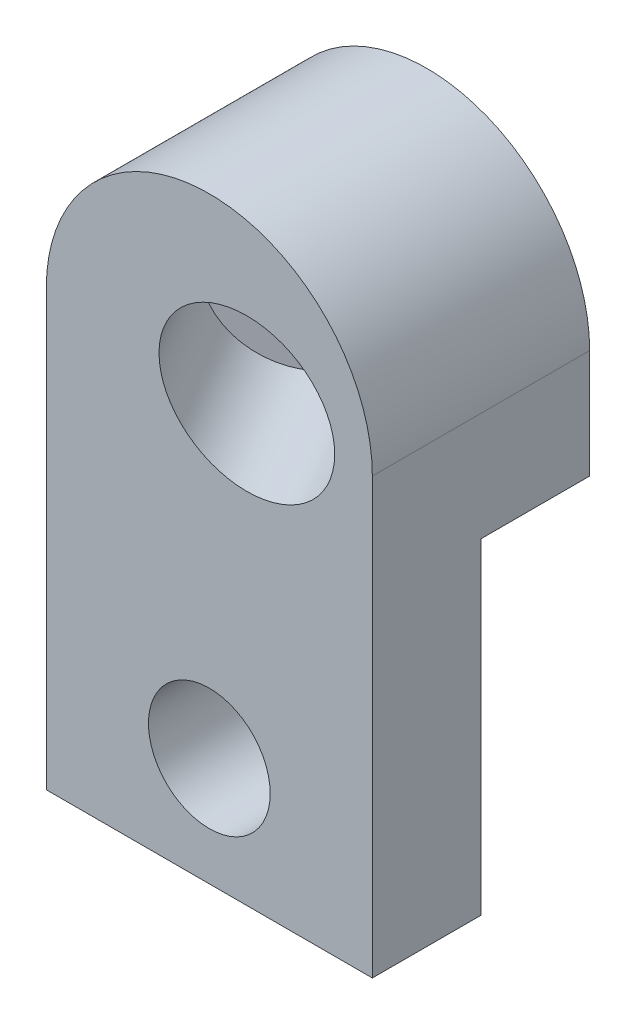
ISO-10303-21;
HEADER;
FILE_DESCRIPTION(('STEP AP214'),'2;1');
FILE_NAME('part.step','',(''),(''),'','','');
FILE_SCHEMA(('AUTOMOTIVE_DESIGN { 1 0 10303 214 1 1 1 1 }'));
ENDSEC;
DATA;
#1=APPLICATION_CONTEXT('core data for automotive mechanical design processes');
#2=APPLICATION_PROTOCOL_DEFINITION('international standard','automotive_design',2000,#1);
#3=PRODUCT_CONTEXT('',#1,'mechanical');
#4=PRODUCT('Part','Part','',(#3));
#5=PRODUCT_RELATED_PRODUCT_CATEGORY('part','',(#4));
#6=PRODUCT_DEFINITION_FORMATION('','',#4);
#7=PRODUCT_DEFINITION_CONTEXT('part definition',#1,'design');
#8=PRODUCT_DEFINITION('design','',#6,#7);
#9=PRODUCT_DEFINITION_SHAPE('','',#8);
#10=(LENGTH_UNIT() NAMED_UNIT(*) SI_UNIT(.MILLI.,.METRE.));
#11=(NAMED_UNIT(*) PLANE_ANGLE_UNIT() SI_UNIT($,.RADIAN.));
#12=(NAMED_UNIT(*) SI_UNIT($,.STERADIAN.) SOLID_ANGLE_UNIT());
#13=UNCERTAINTY_MEASURE_WITH_UNIT(LENGTH_MEASURE(1.E-05),#10,'distance_accuracy_value','');
#14=(GEOMETRIC_REPRESENTATION_CONTEXT(3) GLOBAL_UNCERTAINTY_ASSIGNED_CONTEXT((#13)) GLOBAL_UNIT_ASSIGNED_CONTEXT((#10,
#11,#12)) REPRESENTATION_CONTEXT('',''));
#15=CARTESIAN_POINT('',(0.,0.,0.));
#16=DIRECTION('',(0.,0.,1.));
#17=DIRECTION('',(1.,0.,0.));
#18=AXIS2_PLACEMENT_3D('',#15,#16,#17);
#19=CARTESIAN_POINT('',(7.5,20.,0.));
#20=DIRECTION('',(0.,0.,1.));
#21=DIRECTION('',(1.,0.,0.));
#22=AXIS2_PLACEMENT_3D('',#19,#20,#21);
#23=PLANE('',#22);
#24=CARTESIAN_POINT('',(7.5,5.,0.));
#25=DIRECTION('',(0.,0.,1.));
#26=DIRECTION('',(1.,0.,0.));
#27=AXIS2_PLACEMENT_3D('',#24,#25,#26);
#28=CIRCLE('',#27,2.8);
#29=CARTESIAN_POINT('',(10.3,5.,0.));
#30=VERTEX_POINT('',#29);
#31=EDGE_CURVE('E138',#30,#30,#28,.T.);
#32=ORIENTED_EDGE('',*,*,#31,.T.);
#33=EDGE_LOOP('',(#32));
#34=FACE_BOUND('',#33,.T.);
#35=DIRECTION('',(-1.,0.,0.));
#36=VECTOR('',#35,1.);
#37=CARTESIAN_POINT('',(15.,15.,0.));
#38=LINE('',#37,#36);
#39=CARTESIAN_POINT('',(15.,15.,0.));
#40=VERTEX_POINT('',#39);
#41=CARTESIAN_POINT('',(0.,15.,0.));
#42=VERTEX_POINT('',#41);
#43=EDGE_CURVE('E49',#40,#42,#38,.T.);
#44=ORIENTED_EDGE('',*,*,#43,.F.);
#45=DIRECTION('',(0.,1.,0.));
#46=VECTOR('',#45,1.);
#47=CARTESIAN_POINT('',(15.,0.,0.));
#48=LINE('',#47,#46);
#49=CARTESIAN_POINT('',(15.,0.,0.));
#50=VERTEX_POINT('',#49);
#51=EDGE_CURVE('E131',#50,#40,#48,.T.);
#52=ORIENTED_EDGE('',*,*,#51,.F.);
#53=DIRECTION('',(1.,0.,0.));
#54=VECTOR('',#53,1.);
#55=CARTESIAN_POINT('',(0.,0.,0.));
#56=LINE('',#55,#54);
#57=CARTESIAN_POINT('',(0.,0.,0.));
#58=VERTEX_POINT('',#57);
#59=EDGE_CURVE('E73',#58,#50,#56,.T.);
#60=ORIENTED_EDGE('',*,*,#59,.F.);
#61=DIRECTION('',(0.,-1.,0.));
#62=VECTOR('',#61,1.);
#63=CARTESIAN_POINT('',(0.,20.,0.));
#64=LINE('',#63,#62);
#65=EDGE_CURVE('E145',#42,#58,#64,.T.);
#66=ORIENTED_EDGE('',*,*,#65,.F.);
#67=EDGE_LOOP('',(#44,#52,#60,#66));
#68=FACE_BOUND('',#67,.T.);
#69=ADVANCED_FACE('F32',(#34,#68),#23,.F.);
#70=CARTESIAN_POINT('',(7.5,20.,5.));
#71=DIRECTION('',(0.,0.,1.));
#72=DIRECTION('',(1.,0.,0.));
#73=AXIS2_PLACEMENT_3D('',#70,#71,#72);
#74=PLANE('',#73);
#75=CARTESIAN_POINT('',(9.22649730810373,20.,5.));
#76=DIRECTION('',(0.,0.,1.));
#77=DIRECTION('',(1.,0.,0.));
#78=AXIS2_PLACEMENT_3D('',#75,#76,#77);
#79=ELLIPSE('',#78,4.04145188432738,3.5);
#80=CARTESIAN_POINT('',(13.2679491924311,20.,5.));
#81=VERTEX_POINT('',#80);
#82=EDGE_CURVE('E36',#81,#81,#79,.T.);
#83=ORIENTED_EDGE('',*,*,#82,.F.);
#84=EDGE_LOOP('',(#83));
#85=FACE_BOUND('',#84,.T.);
#86=DIRECTION('',(0.,-1.,0.));
#87=VECTOR('',#86,1.);
#88=CARTESIAN_POINT('',(0.,20.,5.));
#89=LINE('',#88,#87);
#90=CARTESIAN_POINT('',(0.,20.,5.));
#91=VERTEX_POINT('',#90);
#92=CARTESIAN_POINT('',(0.,0.,5.));
#93=VERTEX_POINT('',#92);
#94=EDGE_CURVE('E147',#91,#93,#89,.T.);
#95=ORIENTED_EDGE('',*,*,#94,.T.);
#96=DIRECTION('',(1.,0.,0.));
#97=VECTOR('',#96,1.);
#98=CARTESIAN_POINT('',(0.,0.,5.));
#99=LINE('',#98,#97);
#100=CARTESIAN_POINT('',(15.,0.,5.));
#101=VERTEX_POINT('',#100);
#102=EDGE_CURVE('E78',#93,#101,#99,.T.);
#103=ORIENTED_EDGE('',*,*,#102,.T.);
#104=DIRECTION('',(0.,1.,0.));
#105=VECTOR('',#104,1.);
#106=CARTESIAN_POINT('',(15.,0.,5.));
#107=LINE('',#106,#105);
#108=CARTESIAN_POINT('',(15.,20.,5.));
#109=VERTEX_POINT('',#108);
#110=EDGE_CURVE('E150',#101,#109,#107,.T.);
#111=ORIENTED_EDGE('',*,*,#110,.T.);
#112=CARTESIAN_POINT('',(7.5,20.,5.));
#113=DIRECTION('',(0.,0.,1.));
#114=DIRECTION('',(1.,0.,0.));
#115=AXIS2_PLACEMENT_3D('',#112,#113,#114);
#116=CIRCLE('',#115,7.5);
#117=EDGE_CURVE('E58',#109,#91,#116,.T.);
#118=ORIENTED_EDGE('',*,*,#117,.T.);
#119=EDGE_LOOP('',(#95,#103,#111,#118));
#120=FACE_BOUND('',#119,.T.);
#121=CARTESIAN_POINT('',(7.5,5.,5.));
#122=DIRECTION('',(0.,0.,1.));
#123=DIRECTION('',(1.,0.,0.));
#124=AXIS2_PLACEMENT_3D('',#121,#122,#123);
#125=CIRCLE('',#124,2.8);
#126=CARTESIAN_POINT('',(10.3,5.,5.));
#127=VERTEX_POINT('',#126);
#128=EDGE_CURVE('E127',#127,#127,#125,.T.);
#129=ORIENTED_EDGE('',*,*,#128,.F.);
#130=EDGE_LOOP('',(#129));
#131=FACE_BOUND('',#130,.T.);
#132=ADVANCED_FACE('F161',(#85,#120,#131),#74,.T.);
#133=CARTESIAN_POINT('',(0.,20.,5.));
#134=DIRECTION('',(1.,0.,0.));
#135=DIRECTION('',(0.,1.,0.));
#136=AXIS2_PLACEMENT_3D('',#133,#134,#135);
#137=PLANE('',#136);
#138=DIRECTION('',(0.,0.,-1.));
#139=VECTOR('',#138,1.);
#140=CARTESIAN_POINT('',(0.,20.,5.));
#141=LINE('',#140,#139);
#142=CARTESIAN_POINT('',(0.,20.,-5.));
#143=VERTEX_POINT('',#142);
#144=EDGE_CURVE('E102',#91,#143,#141,.T.);
#145=ORIENTED_EDGE('',*,*,#144,.T.);
#146=DIRECTION('',(0.,1.,0.));
#147=VECTOR('',#146,1.);
#148=CARTESIAN_POINT('',(0.,15.,-5.));
#149=LINE('',#148,#147);
#150=CARTESIAN_POINT('',(0.,15.,-5.));
#151=VERTEX_POINT('',#150);
#152=EDGE_CURVE('E116',#151,#143,#149,.T.);
#153=ORIENTED_EDGE('',*,*,#152,.F.);
#154=DIRECTION('',(0.,0.,1.));
#155=VECTOR('',#154,1.);
#156=CARTESIAN_POINT('',(0.,15.,-5.));
#157=LINE('',#156,#155);
#158=EDGE_CURVE('E124',#151,#42,#157,.T.);
#159=ORIENTED_EDGE('',*,*,#158,.T.);
#160=ORIENTED_EDGE('',*,*,#65,.T.);
#161=DIRECTION('',(0.,0.,-1.));
#162=VECTOR('',#161,1.);
#163=CARTESIAN_POINT('',(0.,0.,5.));
#164=LINE('',#163,#162);
#165=EDGE_CURVE('E11',#93,#58,#164,.T.);
#166=ORIENTED_EDGE('',*,*,#165,.F.);
#167=ORIENTED_EDGE('',*,*,#94,.F.);
#168=EDGE_LOOP('',(#145,#153,#159,#160,#166,#167));
#169=FACE_BOUND('',#168,.T.);
#170=ADVANCED_FACE('F34',(#169),#137,.F.);
#171=CARTESIAN_POINT('',(0.,0.,5.));
#172=DIRECTION('',(0.,1.,0.));
#173=DIRECTION('',(-1.,0.,0.));
#174=AXIS2_PLACEMENT_3D('',#171,#172,#173);
#175=PLANE('',#174);
#176=ORIENTED_EDGE('',*,*,#59,.T.);
#177=DIRECTION('',(0.,0.,-1.));
#178=VECTOR('',#177,1.);
#179=CARTESIAN_POINT('',(15.,0.,5.));
#180=LINE('',#179,#178);
#181=EDGE_CURVE('E41',#101,#50,#180,.T.);
#182=ORIENTED_EDGE('',*,*,#181,.F.);
#183=ORIENTED_EDGE('',*,*,#102,.F.);
#184=ORIENTED_EDGE('',*,*,#165,.T.);
#185=EDGE_LOOP('',(#176,#182,#183,#184));
#186=FACE_BOUND('',#185,.T.);
#187=ADVANCED_FACE('F163',(#186),#175,.F.);
#188=CARTESIAN_POINT('',(15.,0.,5.));
#189=DIRECTION('',(-1.,0.,0.));
#190=DIRECTION('',(0.,-1.,0.));
#191=AXIS2_PLACEMENT_3D('',#188,#189,#190);
#192=PLANE('',#191);
#193=ORIENTED_EDGE('',*,*,#51,.T.);
#194=DIRECTION('',(0.,0.,1.));
#195=VECTOR('',#194,1.);
#196=CARTESIAN_POINT('',(15.,15.,-5.));
#197=LINE('',#196,#195);
#198=CARTESIAN_POINT('',(15.,15.,-5.));
#199=VERTEX_POINT('',#198);
#200=EDGE_CURVE('E108',#199,#40,#197,.T.);
#201=ORIENTED_EDGE('',*,*,#200,.F.);
#202=DIRECTION('',(0.,-1.,0.));
#203=VECTOR('',#202,1.);
#204=CARTESIAN_POINT('',(15.,20.,-5.));
#205=LINE('',#204,#203);
#206=CARTESIAN_POINT('',(15.,20.,-5.));
#207=VERTEX_POINT('',#206);
#208=EDGE_CURVE('E105',#207,#199,#205,.T.);
#209=ORIENTED_EDGE('',*,*,#208,.F.);
#210=DIRECTION('',(0.,0.,-1.));
#211=VECTOR('',#210,1.);
#212=CARTESIAN_POINT('',(15.,20.,5.));
#213=LINE('',#212,#211);
#214=EDGE_CURVE('E95',#109,#207,#213,.T.);
#215=ORIENTED_EDGE('',*,*,#214,.F.);
#216=ORIENTED_EDGE('',*,*,#110,.F.);
#217=ORIENTED_EDGE('',*,*,#181,.T.);
#218=EDGE_LOOP('',(#193,#201,#209,#215,#216,#217));
#219=FACE_BOUND('',#218,.T.);
#220=ADVANCED_FACE('F106',(#219),#192,.F.);
#221=CARTESIAN_POINT('',(7.5,20.,5.));
#222=DIRECTION('',(0.,0.,-1.));
#223=DIRECTION('',(-1.,0.,0.));
#224=AXIS2_PLACEMENT_3D('',#221,#222,#223);
#225=CYLINDRICAL_SURFACE('',#224,7.5);
#226=ORIENTED_EDGE('',*,*,#214,.T.);
#227=CARTESIAN_POINT('',(7.5,20.,-5.));
#228=DIRECTION('',(0.,0.,-1.));
#229=DIRECTION('',(-1.,0.,0.));
#230=AXIS2_PLACEMENT_3D('',#227,#228,#229);
#231=CIRCLE('',#230,7.5);
#232=EDGE_CURVE('E99',#143,#207,#231,.T.);
#233=ORIENTED_EDGE('',*,*,#232,.F.);
#234=ORIENTED_EDGE('',*,*,#144,.F.);
#235=ORIENTED_EDGE('',*,*,#117,.F.);
#236=EDGE_LOOP('',(#226,#233,#234,#235));
#237=FACE_BOUND('',#236,.T.);
#238=ADVANCED_FACE('F97',(#237),#225,.T.);
#239=CARTESIAN_POINT('',(7.5,5.,5.));
#240=DIRECTION('',(0.,0.,-1.));
#241=DIRECTION('',(-1.,0.,0.));
#242=AXIS2_PLACEMENT_3D('',#239,#240,#241);
#243=CYLINDRICAL_SURFACE('',#242,2.8);
#244=ORIENTED_EDGE('',*,*,#128,.T.);
#245=EDGE_LOOP('',(#244));
#246=FACE_BOUND('',#245,.T.);
#247=ORIENTED_EDGE('',*,*,#31,.F.);
#248=EDGE_LOOP('',(#247));
#249=FACE_BOUND('',#248,.T.);
#250=ADVANCED_FACE('F167',(#246,#249),#243,.F.);
#251=CARTESIAN_POINT('',(15.,15.,-5.));
#252=DIRECTION('',(0.,1.,0.));
#253=DIRECTION('',(0.,0.,1.));
#254=AXIS2_PLACEMENT_3D('',#251,#252,#253);
#255=PLANE('',#254);
#256=ORIENTED_EDGE('',*,*,#43,.T.);
#257=ORIENTED_EDGE('',*,*,#158,.F.);
#258=DIRECTION('',(-1.,0.,0.));
#259=VECTOR('',#258,1.);
#260=CARTESIAN_POINT('',(15.,15.,-5.));
#261=LINE('',#260,#259);
#262=EDGE_CURVE('E111',#199,#151,#261,.T.);
#263=ORIENTED_EDGE('',*,*,#262,.F.);
#264=ORIENTED_EDGE('',*,*,#200,.T.);
#265=EDGE_LOOP('',(#256,#257,#263,#264));
#266=FACE_BOUND('',#265,.T.);
#267=ADVANCED_FACE('F165',(#266),#255,.F.);
#268=CARTESIAN_POINT('',(7.5,20.,-5.));
#269=DIRECTION('',(0.,0.,-1.));
#270=DIRECTION('',(-1.,0.,0.));
#271=AXIS2_PLACEMENT_3D('',#268,#269,#270);
#272=PLANE('',#271);
#273=ORIENTED_EDGE('',*,*,#232,.T.);
#274=ORIENTED_EDGE('',*,*,#208,.T.);
#275=ORIENTED_EDGE('',*,*,#262,.T.);
#276=ORIENTED_EDGE('',*,*,#152,.T.);
#277=EDGE_LOOP('',(#273,#274,#275,#276));
#278=FACE_BOUND('',#277,.T.);
#279=ADVANCED_FACE('F114',(#278),#272,.T.);
#280=CARTESIAN_POINT('',(5.66987298107779,20.,-1.16025403784437));
#281=DIRECTION('',(0.500000000000001,0.,0.866025403784438));
#282=DIRECTION('',(0.866025403784438,0.,-0.500000000000001));
#283=AXIS2_PLACEMENT_3D('',#280,#281,#282);
#284=CYLINDRICAL_SURFACE('',#283,3.5);
#285=ORIENTED_EDGE('',*,*,#82,.T.);
#286=EDGE_LOOP('',(#285));
#287=FACE_BOUND('',#286,.T.);
#288=CARTESIAN_POINT('',(5.66987298107779,20.,-1.16025403784437));
#289=DIRECTION('',(0.500000000000001,0.,0.866025403784438));
#290=DIRECTION('',(0.866025403784438,0.,-0.500000000000001));
#291=AXIS2_PLACEMENT_3D('',#288,#289,#290);
#292=CIRCLE('',#291,3.5);
#293=CARTESIAN_POINT('',(8.70096189432333,20.,-2.91025403784438));
#294=VERTEX_POINT('',#293);
#295=EDGE_CURVE('E120',#294,#294,#292,.T.);
#296=ORIENTED_EDGE('',*,*,#295,.F.);
#297=EDGE_LOOP('',(#296));
#298=FACE_BOUND('',#297,.T.);
#299=ADVANCED_FACE('F173',(#287,#298),#284,.F.);
#300=CARTESIAN_POINT('',(5.66987298107779,20.,-1.16025403784437));
#301=DIRECTION('',(0.500000000000001,0.,0.866025403784438));
#302=DIRECTION('',(0.866025403784438,0.,-0.500000000000001));
#303=AXIS2_PLACEMENT_3D('',#300,#301,#302);
#304=PLANE('',#303);
#305=ORIENTED_EDGE('',*,*,#295,.T.);
#306=EDGE_LOOP('',(#305));
#307=FACE_BOUND('',#306,.T.);
#308=ADVANCED_FACE('F212',(#307),#304,.T.);
#309=CLOSED_SHELL('',(#69,#132,#170,#187,#220,#238,#250,#267,#279,#299,#308));
#310=MANIFOLD_SOLID_BREP('B2',#309);
#311=ADVANCED_BREP_SHAPE_REPRESENTATION('',(#18,#310),#14);
#312=SHAPE_DEFINITION_REPRESENTATION(#9,#311);
ENDSEC;
END-ISO-10303-21;
